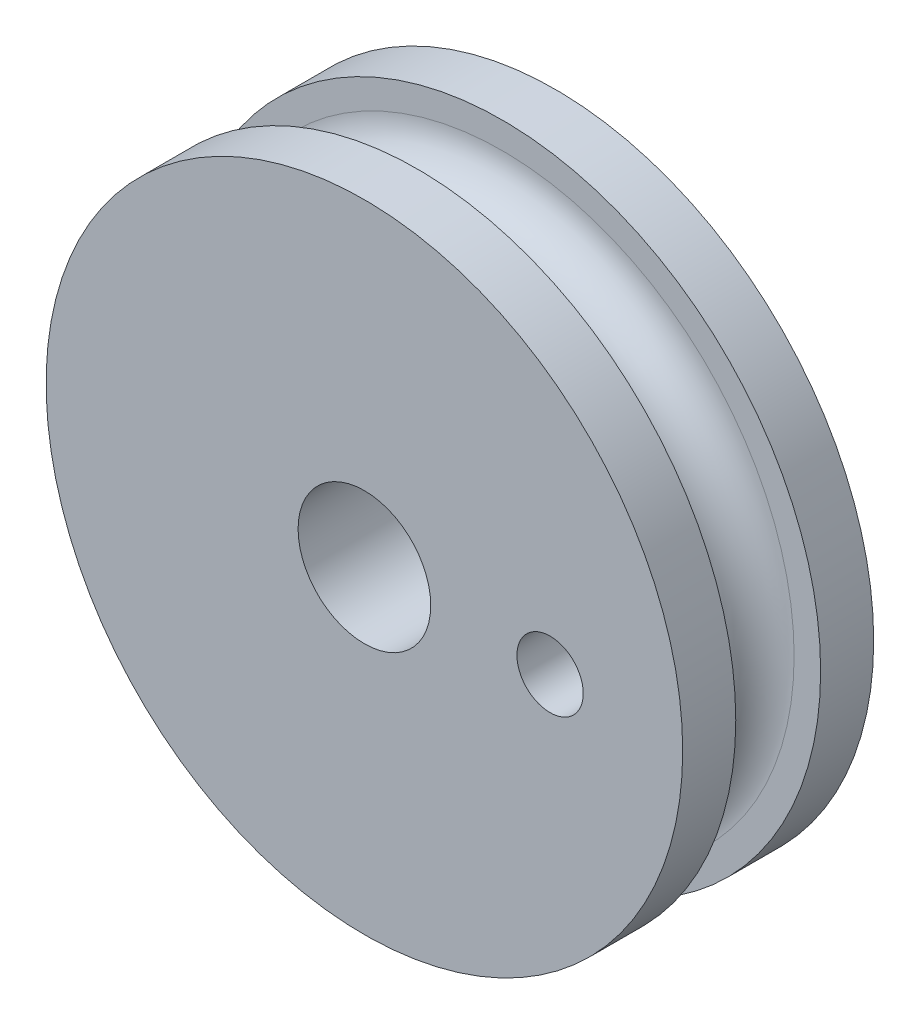
ISO-10303-21;
HEADER;
FILE_DESCRIPTION(('STEP AP214'),'2;1');
FILE_NAME('part.step','',(''),(''),'','','');
FILE_SCHEMA(('AUTOMOTIVE_DESIGN { 1 0 10303 214 1 1 1 1 }'));
ENDSEC;
DATA;
#1=APPLICATION_CONTEXT('core data for automotive mechanical design processes');
#2=APPLICATION_PROTOCOL_DEFINITION('international standard','automotive_design',2000,#1);
#3=PRODUCT_CONTEXT('',#1,'mechanical');
#4=PRODUCT('Part','Part','',(#3));
#5=PRODUCT_RELATED_PRODUCT_CATEGORY('part','',(#4));
#6=PRODUCT_DEFINITION_FORMATION('','',#4);
#7=PRODUCT_DEFINITION_CONTEXT('part definition',#1,'design');
#8=PRODUCT_DEFINITION('design','',#6,#7);
#9=PRODUCT_DEFINITION_SHAPE('','',#8);
#10=(LENGTH_UNIT() NAMED_UNIT(*) SI_UNIT(.MILLI.,.METRE.));
#11=(NAMED_UNIT(*) PLANE_ANGLE_UNIT() SI_UNIT($,.RADIAN.));
#12=(NAMED_UNIT(*) SI_UNIT($,.STERADIAN.) SOLID_ANGLE_UNIT());
#13=UNCERTAINTY_MEASURE_WITH_UNIT(LENGTH_MEASURE(1.E-05),#10,'distance_accuracy_value','');
#14=(GEOMETRIC_REPRESENTATION_CONTEXT(3) GLOBAL_UNCERTAINTY_ASSIGNED_CONTEXT((#13)) GLOBAL_UNIT_ASSIGNED_CONTEXT((#10,
#11,#12)) REPRESENTATION_CONTEXT('',''));
#15=CARTESIAN_POINT('',(0.,0.,0.));
#16=DIRECTION('',(0.,0.,1.));
#17=DIRECTION('',(1.,0.,0.));
#18=AXIS2_PLACEMENT_3D('',#15,#16,#17);
#19=CARTESIAN_POINT('',(0.,0.,2.));
#20=DIRECTION('',(0.,0.,-1.));
#21=DIRECTION('',(-1.,0.,0.));
#22=AXIS2_PLACEMENT_3D('',#19,#20,#21);
#23=CYLINDRICAL_SURFACE('',#22,12.);
#24=CARTESIAN_POINT('',(0.,0.,2.));
#25=DIRECTION('',(0.,0.,1.));
#26=DIRECTION('',(1.,0.,0.));
#27=AXIS2_PLACEMENT_3D('',#24,#25,#26);
#28=CIRCLE('',#27,12.);
#29=CARTESIAN_POINT('',(12.,0.,2.));
#30=VERTEX_POINT('',#29);
#31=EDGE_CURVE('E76',#30,#30,#28,.T.);
#32=ORIENTED_EDGE('',*,*,#31,.F.);
#33=EDGE_LOOP('',(#32));
#34=FACE_BOUND('',#33,.T.);
#35=CARTESIAN_POINT('',(0.,0.,0.));
#36=DIRECTION('',(0.,0.,1.));
#37=DIRECTION('',(1.,0.,0.));
#38=AXIS2_PLACEMENT_3D('',#35,#36,#37);
#39=CIRCLE('',#38,12.);
#40=CARTESIAN_POINT('',(12.,0.,0.));
#41=VERTEX_POINT('',#40);
#42=EDGE_CURVE('E74',#41,#41,#39,.T.);
#43=ORIENTED_EDGE('',*,*,#42,.T.);
#44=EDGE_LOOP('',(#43));
#45=FACE_BOUND('',#44,.T.);
#46=ADVANCED_FACE('F37',(#34,#45),#23,.T.);
#47=CARTESIAN_POINT('',(0.,0.,2.));
#48=DIRECTION('',(0.,0.,1.));
#49=DIRECTION('',(1.,0.,0.));
#50=AXIS2_PLACEMENT_3D('',#47,#48,#49);
#51=PLANE('',#50);
#52=CARTESIAN_POINT('',(0.,0.,2.));
#53=DIRECTION('',(0.,0.,1.));
#54=DIRECTION('',(1.,0.,0.));
#55=AXIS2_PLACEMENT_3D('',#52,#53,#54);
#56=CIRCLE('',#55,11.);
#57=CARTESIAN_POINT('',(11.,0.,2.));
#58=VERTEX_POINT('',#57);
#59=EDGE_CURVE('E44',#58,#58,#56,.T.);
#60=ORIENTED_EDGE('',*,*,#59,.F.);
#61=EDGE_LOOP('',(#60));
#62=FACE_BOUND('',#61,.T.);
#63=ORIENTED_EDGE('',*,*,#31,.T.);
#64=EDGE_LOOP('',(#63));
#65=FACE_BOUND('',#64,.T.);
#66=ADVANCED_FACE('F109',(#62,#65),#51,.T.);
#67=CARTESIAN_POINT('',(0.,0.,0.));
#68=DIRECTION('',(0.,0.,1.));
#69=DIRECTION('',(1.,0.,0.));
#70=AXIS2_PLACEMENT_3D('',#67,#68,#69);
#71=PLANE('',#70);
#72=CARTESIAN_POINT('',(7.,0.,0.));
#73=DIRECTION('',(0.,0.,-1.));
#74=DIRECTION('',(-1.,0.,0.));
#75=AXIS2_PLACEMENT_3D('',#72,#73,#74);
#76=CIRCLE('',#75,1.24999999999999);
#77=CARTESIAN_POINT('',(5.75000000000001,0.,0.));
#78=VERTEX_POINT('',#77);
#79=EDGE_CURVE('E61',#78,#78,#76,.T.);
#80=ORIENTED_EDGE('',*,*,#79,.F.);
#81=EDGE_LOOP('',(#80));
#82=FACE_BOUND('',#81,.T.);
#83=CARTESIAN_POINT('',(0.,0.,0.));
#84=DIRECTION('',(0.,0.,-1.));
#85=DIRECTION('',(-1.,0.,0.));
#86=AXIS2_PLACEMENT_3D('',#83,#84,#85);
#87=CIRCLE('',#86,2.5);
#88=CARTESIAN_POINT('',(-2.5,0.,0.));
#89=VERTEX_POINT('',#88);
#90=EDGE_CURVE('E54',#89,#89,#87,.T.);
#91=ORIENTED_EDGE('',*,*,#90,.F.);
#92=EDGE_LOOP('',(#91));
#93=FACE_BOUND('',#92,.T.);
#94=ORIENTED_EDGE('',*,*,#42,.F.);
#95=EDGE_LOOP('',(#94));
#96=FACE_BOUND('',#95,.T.);
#97=ADVANCED_FACE('F114',(#82,#93,#96),#71,.F.);
#98=CARTESIAN_POINT('',(0.,0.,5.2));
#99=DIRECTION('',(0.,0.,-1.));
#100=DIRECTION('',(-1.,0.,0.));
#101=AXIS2_PLACEMENT_3D('',#98,#99,#100);
#102=CYLINDRICAL_SURFACE('',#101,11.);
#103=CARTESIAN_POINT('',(0.,0.,5.1940203105253));
#104=DIRECTION('',(0.,0.,-1.));
#105=DIRECTION('',(-1.,0.,0.));
#106=AXIS2_PLACEMENT_3D('',#103,#104,#105);
#107=CIRCLE('',#106,11.);
#108=CARTESIAN_POINT('',(11.,0.,5.1940203105253));
#109=VERTEX_POINT('',#108);
#110=EDGE_CURVE('E11',#109,#109,#107,.F.);
#111=ORIENTED_EDGE('',*,*,#110,.T.);
#112=EDGE_LOOP('',(#111));
#113=FACE_BOUND('',#112,.T.);
#114=CARTESIAN_POINT('',(0.,0.,5.2));
#115=DIRECTION('',(0.,0.,1.));
#116=DIRECTION('',(1.,0.,0.));
#117=AXIS2_PLACEMENT_3D('',#114,#115,#116);
#118=CIRCLE('',#117,11.);
#119=CARTESIAN_POINT('',(11.,0.,5.2));
#120=VERTEX_POINT('',#119);
#121=EDGE_CURVE('E68',#120,#120,#118,.T.);
#122=ORIENTED_EDGE('',*,*,#121,.F.);
#123=EDGE_LOOP('',(#122));
#124=FACE_BOUND('',#123,.T.);
#125=ADVANCED_FACE('F97',(#113,#124),#102,.T.);
#126=CARTESIAN_POINT('',(0.,0.,7.2));
#127=DIRECTION('',(0.,0.,-1.));
#128=DIRECTION('',(-1.,0.,0.));
#129=AXIS2_PLACEMENT_3D('',#126,#127,#128);
#130=CYLINDRICAL_SURFACE('',#129,12.);
#131=CARTESIAN_POINT('',(0.,0.,7.2));
#132=DIRECTION('',(0.,0.,1.));
#133=DIRECTION('',(1.,0.,0.));
#134=AXIS2_PLACEMENT_3D('',#131,#132,#133);
#135=CIRCLE('',#134,12.);
#136=CARTESIAN_POINT('',(12.,0.,7.2));
#137=VERTEX_POINT('',#136);
#138=EDGE_CURVE('E65',#137,#137,#135,.T.);
#139=ORIENTED_EDGE('',*,*,#138,.F.);
#140=EDGE_LOOP('',(#139));
#141=FACE_BOUND('',#140,.T.);
#142=CARTESIAN_POINT('',(0.,0.,5.2));
#143=DIRECTION('',(0.,0.,1.));
#144=DIRECTION('',(1.,0.,0.));
#145=AXIS2_PLACEMENT_3D('',#142,#143,#144);
#146=CIRCLE('',#145,12.);
#147=CARTESIAN_POINT('',(12.,0.,5.2));
#148=VERTEX_POINT('',#147);
#149=EDGE_CURVE('E69',#148,#148,#146,.T.);
#150=ORIENTED_EDGE('',*,*,#149,.T.);
#151=EDGE_LOOP('',(#150));
#152=FACE_BOUND('',#151,.T.);
#153=ADVANCED_FACE('F90',(#141,#152),#130,.T.);
#154=CARTESIAN_POINT('',(0.,0.,7.2));
#155=DIRECTION('',(0.,0.,1.));
#156=DIRECTION('',(1.,0.,0.));
#157=AXIS2_PLACEMENT_3D('',#154,#155,#156);
#158=PLANE('',#157);
#159=CARTESIAN_POINT('',(7.,0.,7.2));
#160=DIRECTION('',(0.,0.,1.));
#161=DIRECTION('',(1.,0.,0.));
#162=AXIS2_PLACEMENT_3D('',#159,#160,#161);
#163=CIRCLE('',#162,1.24999999999999);
#164=CARTESIAN_POINT('',(8.24999999999999,0.,7.2));
#165=VERTEX_POINT('',#164);
#166=EDGE_CURVE('E55',#165,#165,#163,.T.);
#167=ORIENTED_EDGE('',*,*,#166,.F.);
#168=EDGE_LOOP('',(#167));
#169=FACE_BOUND('',#168,.T.);
#170=CARTESIAN_POINT('',(0.,0.,7.2));
#171=DIRECTION('',(0.,0.,1.));
#172=DIRECTION('',(1.,0.,0.));
#173=AXIS2_PLACEMENT_3D('',#170,#171,#172);
#174=CIRCLE('',#173,2.5);
#175=CARTESIAN_POINT('',(2.5,0.,7.2));
#176=VERTEX_POINT('',#175);
#177=EDGE_CURVE('E58',#176,#176,#174,.T.);
#178=ORIENTED_EDGE('',*,*,#177,.F.);
#179=EDGE_LOOP('',(#178));
#180=FACE_BOUND('',#179,.T.);
#181=ORIENTED_EDGE('',*,*,#138,.T.);
#182=EDGE_LOOP('',(#181));
#183=FACE_BOUND('',#182,.T.);
#184=ADVANCED_FACE('F86',(#169,#180,#183),#158,.T.);
#185=CARTESIAN_POINT('',(0.,0.,5.2));
#186=DIRECTION('',(0.,0.,1.));
#187=DIRECTION('',(1.,0.,0.));
#188=AXIS2_PLACEMENT_3D('',#185,#186,#187);
#189=PLANE('',#188);
#190=ORIENTED_EDGE('',*,*,#121,.T.);
#191=EDGE_LOOP('',(#190));
#192=FACE_BOUND('',#191,.T.);
#193=ORIENTED_EDGE('',*,*,#149,.F.);
#194=EDGE_LOOP('',(#193));
#195=FACE_BOUND('',#194,.T.);
#196=ADVANCED_FACE('F89',(#192,#195),#189,.F.);
#197=CARTESIAN_POINT('',(0.,0.,30.));
#198=DIRECTION('',(0.,0.,-1.));
#199=DIRECTION('',(-1.,0.,0.));
#200=AXIS2_PLACEMENT_3D('',#197,#198,#199);
#201=CYLINDRICAL_SURFACE('',#200,2.5);
#202=ORIENTED_EDGE('',*,*,#177,.T.);
#203=EDGE_LOOP('',(#202));
#204=FACE_BOUND('',#203,.T.);
#205=ORIENTED_EDGE('',*,*,#90,.T.);
#206=EDGE_LOOP('',(#205));
#207=FACE_BOUND('',#206,.T.);
#208=ADVANCED_FACE('F83',(#204,#207),#201,.F.);
#209=CARTESIAN_POINT('',(0.,0.,3.59701015526265));
#210=DIRECTION('',(0.,0.,1.));
#211=DIRECTION('',(1.,0.,0.));
#212=AXIS2_PLACEMENT_3D('',#209,#210,#211);
#213=TOROIDAL_SURFACE('',#212,11.,1.59701015526265);
#214=CARTESIAN_POINT('',(11.,0.,3.59701015526265));
#215=DIRECTION('',(0.,1.,0.));
#216=DIRECTION('',(0.,0.,1.));
#217=AXIS2_PLACEMENT_3D('',#214,#215,#216);
#218=CIRCLE('',#217,1.59701015526265);
#219=EDGE_CURVE('E51',#58,#109,#218,.T.);
#220=ORIENTED_EDGE('',*,*,#219,.F.);
#221=ORIENTED_EDGE('',*,*,#59,.T.);
#222=ORIENTED_EDGE('',*,*,#219,.T.);
#223=ORIENTED_EDGE('',*,*,#110,.F.);
#224=EDGE_LOOP('',(#220,#221,#222,#223));
#225=FACE_BOUND('',#224,.T.);
#226=ADVANCED_FACE('F52',(#225),#213,.F.);
#227=CARTESIAN_POINT('',(7.,0.,0.));
#228=DIRECTION('',(0.,0.,-1.));
#229=DIRECTION('',(-1.,0.,0.));
#230=AXIS2_PLACEMENT_3D('',#227,#228,#229);
#231=CYLINDRICAL_SURFACE('',#230,1.24999999999999);
#232=ORIENTED_EDGE('',*,*,#166,.T.);
#233=EDGE_LOOP('',(#232));
#234=FACE_BOUND('',#233,.T.);
#235=ORIENTED_EDGE('',*,*,#79,.T.);
#236=EDGE_LOOP('',(#235));
#237=FACE_BOUND('',#236,.T.);
#238=ADVANCED_FACE('F133',(#234,#237),#231,.F.);
#239=CLOSED_SHELL('',(#46,#66,#97,#125,#153,#184,#196,#208,#226,#238));
#240=MANIFOLD_SOLID_BREP('B2',#239);
#241=ADVANCED_BREP_SHAPE_REPRESENTATION('',(#18,#240),#14);
#242=SHAPE_DEFINITION_REPRESENTATION(#9,#241);
ENDSEC;
END-ISO-10303-21;
